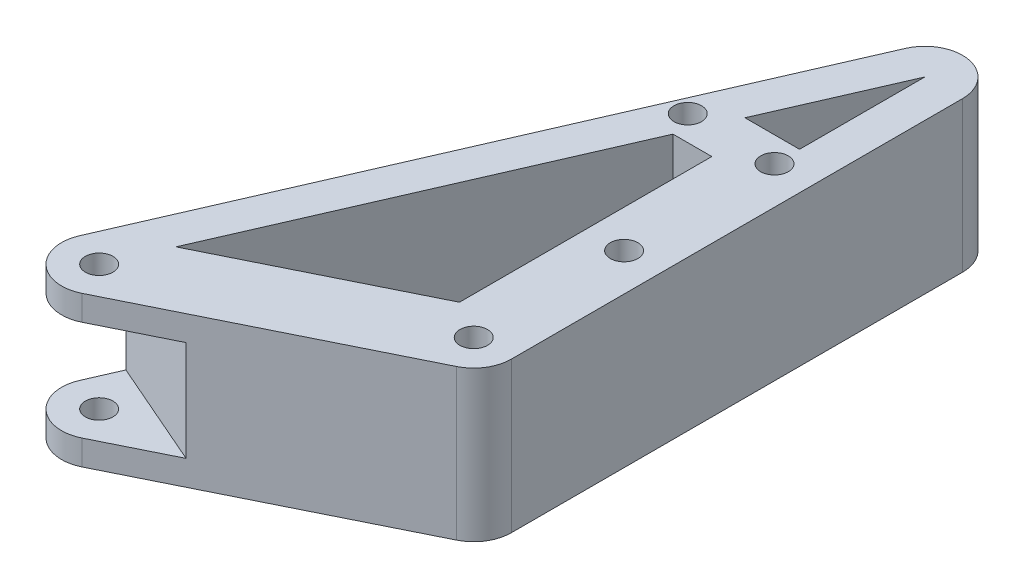
ISO-10303-21;
HEADER;
FILE_DESCRIPTION(('STEP AP214'),'2;1');
FILE_NAME('part.step','',(''),(''),'','','');
FILE_SCHEMA(('AUTOMOTIVE_DESIGN { 1 0 10303 214 1 1 1 1 }'));
ENDSEC;
DATA;
#1=APPLICATION_CONTEXT('core data for automotive mechanical design processes');
#2=APPLICATION_PROTOCOL_DEFINITION('international standard','automotive_design',2000,#1);
#3=PRODUCT_CONTEXT('',#1,'mechanical');
#4=PRODUCT('Part','Part','',(#3));
#5=PRODUCT_RELATED_PRODUCT_CATEGORY('part','',(#4));
#6=PRODUCT_DEFINITION_FORMATION('','',#4);
#7=PRODUCT_DEFINITION_CONTEXT('part definition',#1,'design');
#8=PRODUCT_DEFINITION('design','',#6,#7);
#9=PRODUCT_DEFINITION_SHAPE('','',#8);
#10=(LENGTH_UNIT() NAMED_UNIT(*) SI_UNIT(.MILLI.,.METRE.));
#11=(NAMED_UNIT(*) PLANE_ANGLE_UNIT() SI_UNIT($,.RADIAN.));
#12=(NAMED_UNIT(*) SI_UNIT($,.STERADIAN.) SOLID_ANGLE_UNIT());
#13=UNCERTAINTY_MEASURE_WITH_UNIT(LENGTH_MEASURE(1.E-05),#10,'distance_accuracy_value','');
#14=(GEOMETRIC_REPRESENTATION_CONTEXT(3) GLOBAL_UNCERTAINTY_ASSIGNED_CONTEXT((#13)) GLOBAL_UNIT_ASSIGNED_CONTEXT((#10,
#11,#12)) REPRESENTATION_CONTEXT('',''));
#15=CARTESIAN_POINT('',(0.,0.,0.));
#16=DIRECTION('',(0.,0.,1.));
#17=DIRECTION('',(1.,0.,0.));
#18=AXIS2_PLACEMENT_3D('',#15,#16,#17);
#19=CARTESIAN_POINT('',(-6.49728373742447,30.,-13.1415287829184));
#20=DIRECTION('',(-0.443199232411597,0.,-0.896423136911231));
#21=DIRECTION('',(-0.896423136911231,0.,0.443199232411597));
#22=AXIS2_PLACEMENT_3D('',#19,#20,#21);
#23=PLANE('',#22);
#24=DIRECTION('',(-0.896423136911231,0.,0.443199232411597));
#25=VECTOR('',#24,1.);
#26=CARTESIAN_POINT('',(-6.49728373742447,25.,-13.1415287829184));
#27=LINE('',#26,#25);
#28=CARTESIAN_POINT('',(-32.7975945113373,25.,-0.138431175076462));
#29=VERTEX_POINT('',#28);
#30=CARTESIAN_POINT('',(-46.676005756913,25.,6.72317352683422));
#31=VERTEX_POINT('',#30);
#32=EDGE_CURVE('E390',#29,#31,#27,.T.);
#33=ORIENTED_EDGE('',*,*,#32,.F.);
#34=DIRECTION('',(0.,1.,0.));
#35=VECTOR('',#34,1.);
#36=CARTESIAN_POINT('',(-32.7975945113373,30.,-0.13843117507647));
#37=LINE('',#36,#35);
#38=CARTESIAN_POINT('',(-32.7975945113373,5.,-0.138431175076467));
#39=VERTEX_POINT('',#38);
#40=EDGE_CURVE('E206',#39,#29,#37,.T.);
#41=ORIENTED_EDGE('',*,*,#40,.F.);
#42=DIRECTION('',(0.896423136911231,0.,-0.443199232411597));
#43=VECTOR('',#42,1.);
#44=CARTESIAN_POINT('',(-6.49728373742447,5.,-13.1415287829184));
#45=LINE('',#44,#43);
#46=CARTESIAN_POINT('',(-46.676005756913,5.,6.72317352683422));
#47=VERTEX_POINT('',#46);
#48=EDGE_CURVE('E391',#47,#39,#45,.T.);
#49=ORIENTED_EDGE('',*,*,#48,.F.);
#50=DIRECTION('',(0.,-1.,0.));
#51=VECTOR('',#50,1.);
#52=CARTESIAN_POINT('',(-46.676005756913,30.,6.72317352683423));
#53=LINE('',#52,#51);
#54=CARTESIAN_POINT('',(-46.676005756913,0.,6.72317352683423));
#55=VERTEX_POINT('',#54);
#56=EDGE_CURVE('E179',#47,#55,#53,.T.);
#57=ORIENTED_EDGE('',*,*,#56,.T.);
#58=DIRECTION('',(0.896423136911231,0.,-0.443199232411597));
#59=VECTOR('',#58,1.);
#60=CARTESIAN_POINT('',(-6.49728373742447,0.,-13.1415287829184));
#61=LINE('',#60,#59);
#62=CARTESIAN_POINT('',(3.32399424308698,0.,-17.9972522499207));
#63=VERTEX_POINT('',#62);
#64=EDGE_CURVE('E199',#55,#63,#61,.T.);
#65=ORIENTED_EDGE('',*,*,#64,.T.);
#66=DIRECTION('',(0.,-1.,0.));
#67=VECTOR('',#66,1.);
#68=CARTESIAN_POINT('',(3.32399424308698,30.,-17.9972522499207));
#69=LINE('',#68,#67);
#70=CARTESIAN_POINT('',(3.32399424308698,30.,-17.9972522499207));
#71=VERTEX_POINT('',#70);
#72=EDGE_CURVE('E169',#71,#63,#69,.T.);
#73=ORIENTED_EDGE('',*,*,#72,.F.);
#74=DIRECTION('',(0.896423136911231,0.,-0.443199232411597));
#75=VECTOR('',#74,1.);
#76=CARTESIAN_POINT('',(-6.49728373742447,30.,-13.1415287829184));
#77=LINE('',#76,#75);
#78=CARTESIAN_POINT('',(-46.676005756913,30.,6.72317352683423));
#79=VERTEX_POINT('',#78);
#80=EDGE_CURVE('E257',#79,#71,#77,.T.);
#81=ORIENTED_EDGE('',*,*,#80,.F.);
#82=EDGE_CURVE('E175',#79,#31,#53,.T.);
#83=ORIENTED_EDGE('',*,*,#82,.T.);
#84=EDGE_LOOP('',(#33,#41,#49,#57,#65,#73,#81,#83));
#85=FACE_BOUND('',#84,.T.);
#86=ADVANCED_FACE('F33',(#85),#23,.F.);
#87=CARTESIAN_POINT('',(-48.8936344096675,30.,-21.3099080127257));
#88=DIRECTION('',(0.916714519503143,0.,0.399542850933566));
#89=DIRECTION('',(0.399542850933566,0.,-0.916714519503143));
#90=AXIS2_PLACEMENT_3D('',#87,#88,#89);
#91=PLANE('',#90);
#92=DIRECTION('',(-0.399542850933566,0.,0.916714519503143));
#93=VECTOR('',#92,1.);
#94=CARTESIAN_POINT('',(-48.8936344096675,25.,-21.3099080127257));
#95=LINE('',#94,#93);
#96=CARTESIAN_POINT('',(-54.0785589397386,25.,-9.41357301852373));
#97=VERTEX_POINT('',#96);
#98=CARTESIAN_POINT('',(-56.8753588962736,25.,-2.99657138200173));
#99=VERTEX_POINT('',#98);
#100=EDGE_CURVE('E424',#97,#99,#95,.T.);
#101=ORIENTED_EDGE('',*,*,#100,.T.);
#102=DIRECTION('',(0.,-1.,0.));
#103=VECTOR('',#102,1.);
#104=CARTESIAN_POINT('',(-56.8753588962736,30.,-2.99657138200173));
#105=LINE('',#104,#103);
#106=CARTESIAN_POINT('',(-56.8753588962736,30.,-2.99657138200173));
#107=VERTEX_POINT('',#106);
#108=EDGE_CURVE('E180',#107,#99,#105,.T.);
#109=ORIENTED_EDGE('',*,*,#108,.F.);
#110=DIRECTION('',(-0.399542850933566,0.,0.916714519503143));
#111=VECTOR('',#110,1.);
#112=CARTESIAN_POINT('',(-48.8936344096675,30.,-21.3099080127257));
#113=LINE('',#112,#111);
#114=CARTESIAN_POINT('',(-6.87535889627355,30.,-117.716997158757));
#115=VERTEX_POINT('',#114);
#116=EDGE_CURVE('E269',#115,#107,#113,.T.);
#117=ORIENTED_EDGE('',*,*,#116,.F.);
#118=DIRECTION('',(0.,-1.,0.));
#119=VECTOR('',#118,1.);
#120=CARTESIAN_POINT('',(-6.87535889627355,30.,-117.716997158757));
#121=LINE('',#120,#119);
#122=CARTESIAN_POINT('',(-6.87535889627355,0.,-117.716997158757));
#123=VERTEX_POINT('',#122);
#124=EDGE_CURVE('E183',#115,#123,#121,.T.);
#125=ORIENTED_EDGE('',*,*,#124,.T.);
#126=DIRECTION('',(-0.399542850933566,0.,0.916714519503143));
#127=VECTOR('',#126,1.);
#128=CARTESIAN_POINT('',(-48.8936344096675,0.,-21.3099080127257));
#129=LINE('',#128,#127);
#130=CARTESIAN_POINT('',(-56.8753588962736,0.,-2.99657138200173));
#131=VERTEX_POINT('',#130);
#132=EDGE_CURVE('E220',#123,#131,#129,.T.);
#133=ORIENTED_EDGE('',*,*,#132,.T.);
#134=CARTESIAN_POINT('',(-56.8753588962736,5.,-2.99657138200173));
#135=VERTEX_POINT('',#134);
#136=EDGE_CURVE('E178',#135,#131,#105,.T.);
#137=ORIENTED_EDGE('',*,*,#136,.F.);
#138=DIRECTION('',(0.399542850933566,0.,-0.916714519503143));
#139=VECTOR('',#138,1.);
#140=CARTESIAN_POINT('',(-48.8936344096675,5.,-21.3099080127257));
#141=LINE('',#140,#139);
#142=CARTESIAN_POINT('',(-54.0785589397386,5.,-9.41357301852373));
#143=VERTEX_POINT('',#142);
#144=EDGE_CURVE('E47',#135,#143,#141,.T.);
#145=ORIENTED_EDGE('',*,*,#144,.T.);
#146=DIRECTION('',(0.,1.,0.));
#147=VECTOR('',#146,1.);
#148=CARTESIAN_POINT('',(-54.0785589397386,0.,-9.41357301852373));
#149=LINE('',#148,#147);
#150=EDGE_CURVE('E427',#143,#97,#149,.T.);
#151=ORIENTED_EDGE('',*,*,#150,.T.);
#152=EDGE_LOOP('',(#101,#109,#117,#125,#133,#137,#145,#151));
#153=FACE_BOUND('',#152,.T.);
#154=ADVANCED_FACE('F316',(#153),#91,.F.);
#155=CARTESIAN_POINT('',(-50.,30.,0.));
#156=DIRECTION('',(0.,-1.,0.));
#157=DIRECTION('',(0.,0.,-1.));
#158=AXIS2_PLACEMENT_3D('',#155,#156,#157);
#159=CYLINDRICAL_SURFACE('',#158,2.75);
#160=CARTESIAN_POINT('',(-50.,30.,0.));
#161=DIRECTION('',(0.,1.,0.));
#162=DIRECTION('',(0.,0.,1.));
#163=AXIS2_PLACEMENT_3D('',#160,#161,#162);
#164=CIRCLE('',#163,2.75);
#165=CARTESIAN_POINT('',(-50.,30.,2.75000000000001));
#166=VERTEX_POINT('',#165);
#167=EDGE_CURVE('E292',#166,#166,#164,.T.);
#168=ORIENTED_EDGE('',*,*,#167,.T.);
#169=EDGE_LOOP('',(#168));
#170=FACE_BOUND('',#169,.T.);
#171=CARTESIAN_POINT('',(-50.,25.,0.));
#172=DIRECTION('',(0.,-1.,0.));
#173=DIRECTION('',(0.,0.,-1.));
#174=AXIS2_PLACEMENT_3D('',#171,#172,#173);
#175=CIRCLE('',#174,2.75);
#176=CARTESIAN_POINT('',(-50.,25.,-2.75));
#177=VERTEX_POINT('',#176);
#178=EDGE_CURVE('E211',#177,#177,#175,.T.);
#179=ORIENTED_EDGE('',*,*,#178,.T.);
#180=EDGE_LOOP('',(#179));
#181=FACE_BOUND('',#180,.T.);
#182=ADVANCED_FACE('F320',(#170,#181),#159,.F.);
#183=CARTESIAN_POINT('',(-50.,0.,0.));
#184=DIRECTION('',(0.,1.,0.));
#185=DIRECTION('',(0.,0.,1.));
#186=AXIS2_PLACEMENT_3D('',#183,#184,#185);
#187=CIRCLE('',#186,2.75);
#188=CARTESIAN_POINT('',(-50.,0.,2.75000000000001));
#189=VERTEX_POINT('',#188);
#190=EDGE_CURVE('E252',#189,#189,#187,.T.);
#191=ORIENTED_EDGE('',*,*,#190,.F.);
#192=EDGE_LOOP('',(#191));
#193=FACE_BOUND('',#192,.T.);
#194=CARTESIAN_POINT('',(-50.,5.,0.));
#195=DIRECTION('',(0.,1.,0.));
#196=DIRECTION('',(0.,0.,1.));
#197=AXIS2_PLACEMENT_3D('',#194,#195,#196);
#198=CIRCLE('',#197,2.75);
#199=CARTESIAN_POINT('',(-50.,5.,2.75000000000001));
#200=VERTEX_POINT('',#199);
#201=EDGE_CURVE('E388',#200,#200,#198,.T.);
#202=ORIENTED_EDGE('',*,*,#201,.T.);
#203=EDGE_LOOP('',(#202));
#204=FACE_BOUND('',#203,.T.);
#205=ADVANCED_FACE('F326',(#193,#204),#159,.F.);
#206=CARTESIAN_POINT('',(-50.,30.,0.));
#207=DIRECTION('',(0.,-1.,0.));
#208=DIRECTION('',(0.,0.,-1.));
#209=AXIS2_PLACEMENT_3D('',#206,#207,#208);
#210=CYLINDRICAL_SURFACE('',#209,7.49999999999999);
#211=CARTESIAN_POINT('',(-50.,25.,0.));
#212=DIRECTION('',(0.,-1.,0.));
#213=DIRECTION('',(0.,0.,-1.));
#214=AXIS2_PLACEMENT_3D('',#211,#212,#213);
#215=CIRCLE('',#214,7.49999999999999);
#216=EDGE_CURVE('E11',#31,#99,#215,.T.);
#217=ORIENTED_EDGE('',*,*,#216,.F.);
#218=ORIENTED_EDGE('',*,*,#82,.F.);
#219=CARTESIAN_POINT('',(-50.,30.,0.));
#220=DIRECTION('',(0.,1.,0.));
#221=DIRECTION('',(0.,0.,1.));
#222=AXIS2_PLACEMENT_3D('',#219,#220,#221);
#223=CIRCLE('',#222,7.49999999999999);
#224=EDGE_CURVE('E271',#107,#79,#223,.T.);
#225=ORIENTED_EDGE('',*,*,#224,.F.);
#226=ORIENTED_EDGE('',*,*,#108,.T.);
#227=EDGE_LOOP('',(#217,#218,#225,#226));
#228=FACE_BOUND('',#227,.T.);
#229=ADVANCED_FACE('F331',(#228),#210,.T.);
#230=CARTESIAN_POINT('',(-50.,5.,0.));
#231=DIRECTION('',(0.,1.,0.));
#232=DIRECTION('',(0.,0.,1.));
#233=AXIS2_PLACEMENT_3D('',#230,#231,#232);
#234=CIRCLE('',#233,7.49999999999999);
#235=EDGE_CURVE('E40',#135,#47,#234,.T.);
#236=ORIENTED_EDGE('',*,*,#235,.F.);
#237=ORIENTED_EDGE('',*,*,#136,.T.);
#238=CARTESIAN_POINT('',(-50.,0.,0.));
#239=DIRECTION('',(0.,1.,0.));
#240=DIRECTION('',(0.,0.,1.));
#241=AXIS2_PLACEMENT_3D('',#238,#239,#240);
#242=CIRCLE('',#241,7.49999999999999);
#243=EDGE_CURVE('E223',#131,#55,#242,.T.);
#244=ORIENTED_EDGE('',*,*,#243,.T.);
#245=ORIENTED_EDGE('',*,*,#56,.F.);
#246=EDGE_LOOP('',(#236,#237,#244,#245));
#247=FACE_BOUND('',#246,.T.);
#248=ADVANCED_FACE('F441',(#247),#210,.T.);
#249=CARTESIAN_POINT('',(0.,30.,0.));
#250=DIRECTION('',(1.,0.,0.));
#251=DIRECTION('',(0.,0.,-1.));
#252=AXIS2_PLACEMENT_3D('',#249,#250,#251);
#253=PLANE('',#252);
#254=DIRECTION('',(0.,0.,1.));
#255=VECTOR('',#254,1.);
#256=CARTESIAN_POINT('',(0.,0.,0.));
#257=LINE('',#256,#255);
#258=CARTESIAN_POINT('',(0.,0.,-114.720425776755));
#259=VERTEX_POINT('',#258);
#260=CARTESIAN_POINT('',(0.,0.,-89.7204257767549));
#261=VERTEX_POINT('',#260);
#262=EDGE_CURVE('E161',#259,#261,#257,.T.);
#263=ORIENTED_EDGE('',*,*,#262,.T.);
#264=DIRECTION('',(0.,-1.,0.));
#265=VECTOR('',#264,1.);
#266=CARTESIAN_POINT('',(0.,30.,-89.7204257767549));
#267=LINE('',#266,#265);
#268=CARTESIAN_POINT('',(0.,30.,-89.7204257767549));
#269=VERTEX_POINT('',#268);
#270=EDGE_CURVE('E149',#269,#261,#267,.T.);
#271=ORIENTED_EDGE('',*,*,#270,.F.);
#272=DIRECTION('',(0.,0.,1.));
#273=VECTOR('',#272,1.);
#274=CARTESIAN_POINT('',(0.,30.,0.));
#275=LINE('',#274,#273);
#276=CARTESIAN_POINT('',(0.,30.,-114.720425776755));
#277=VERTEX_POINT('',#276);
#278=EDGE_CURVE('E154',#277,#269,#275,.T.);
#279=ORIENTED_EDGE('',*,*,#278,.F.);
#280=DIRECTION('',(0.,-1.,0.));
#281=VECTOR('',#280,1.);
#282=CARTESIAN_POINT('',(0.,30.,-114.720425776755));
#283=LINE('',#282,#281);
#284=EDGE_CURVE('E56',#277,#259,#283,.T.);
#285=ORIENTED_EDGE('',*,*,#284,.T.);
#286=EDGE_LOOP('',(#263,#271,#279,#285));
#287=FACE_BOUND('',#286,.T.);
#288=ADVANCED_FACE('F160',(#287),#253,.F.);
#289=CARTESIAN_POINT('',(0.,30.,-89.7204257767549));
#290=DIRECTION('',(0.,0.,1.));
#291=DIRECTION('',(1.,0.,0.));
#292=AXIS2_PLACEMENT_3D('',#289,#290,#291);
#293=PLANE('',#292);
#294=DIRECTION('',(-1.,0.,0.));
#295=VECTOR('',#294,1.);
#296=CARTESIAN_POINT('',(0.,0.,-89.7204257767549));
#297=LINE('',#296,#295);
#298=CARTESIAN_POINT('',(-10.8960543995233,0.,-89.7204257767549));
#299=VERTEX_POINT('',#298);
#300=EDGE_CURVE('E247',#261,#299,#297,.T.);
#301=ORIENTED_EDGE('',*,*,#300,.T.);
#302=DIRECTION('',(0.,-1.,0.));
#303=VECTOR('',#302,1.);
#304=CARTESIAN_POINT('',(-10.8960543995233,30.,-89.7204257767549));
#305=LINE('',#304,#303);
#306=CARTESIAN_POINT('',(-10.8960543995233,30.,-89.7204257767549));
#307=VERTEX_POINT('',#306);
#308=EDGE_CURVE('E150',#307,#299,#305,.T.);
#309=ORIENTED_EDGE('',*,*,#308,.F.);
#310=DIRECTION('',(-1.,0.,0.));
#311=VECTOR('',#310,1.);
#312=CARTESIAN_POINT('',(0.,30.,-89.7204257767549));
#313=LINE('',#312,#311);
#314=EDGE_CURVE('E144',#269,#307,#313,.T.);
#315=ORIENTED_EDGE('',*,*,#314,.F.);
#316=ORIENTED_EDGE('',*,*,#270,.T.);
#317=EDGE_LOOP('',(#301,#309,#315,#316));
#318=FACE_BOUND('',#317,.T.);
#319=ADVANCED_FACE('F147',(#318),#293,.F.);
#320=CARTESIAN_POINT('',(-7.49999999999999,30.,0.));
#321=DIRECTION('',(1.,0.,0.));
#322=DIRECTION('',(0.,0.,-1.));
#323=AXIS2_PLACEMENT_3D('',#320,#321,#322);
#324=PLANE('',#323);
#325=DIRECTION('',(0.,0.,1.));
#326=VECTOR('',#325,1.);
#327=CARTESIAN_POINT('',(-7.49999999999999,0.,0.));
#328=LINE('',#327,#326);
#329=CARTESIAN_POINT('',(-7.50000000000001,0.,-79.7204257767549));
#330=VERTEX_POINT('',#329);
#331=CARTESIAN_POINT('',(-7.49999999999999,0.,-29.3789464964477));
#332=VERTEX_POINT('',#331);
#333=EDGE_CURVE('E228',#330,#332,#328,.T.);
#334=ORIENTED_EDGE('',*,*,#333,.T.);
#335=DIRECTION('',(0.,-1.,0.));
#336=VECTOR('',#335,1.);
#337=CARTESIAN_POINT('',(-7.49999999999999,30.,-29.3789464964477));
#338=LINE('',#337,#336);
#339=CARTESIAN_POINT('',(-7.49999999999999,30.,-29.3789464964477));
#340=VERTEX_POINT('',#339);
#341=EDGE_CURVE('E173',#340,#332,#338,.T.);
#342=ORIENTED_EDGE('',*,*,#341,.F.);
#343=DIRECTION('',(0.,0.,1.));
#344=VECTOR('',#343,1.);
#345=CARTESIAN_POINT('',(-7.49999999999999,30.,0.));
#346=LINE('',#345,#344);
#347=CARTESIAN_POINT('',(-7.50000000000001,30.,-79.7204257767549));
#348=VERTEX_POINT('',#347);
#349=EDGE_CURVE('E276',#348,#340,#346,.T.);
#350=ORIENTED_EDGE('',*,*,#349,.F.);
#351=DIRECTION('',(0.,-1.,0.));
#352=VECTOR('',#351,1.);
#353=CARTESIAN_POINT('',(-7.50000000000001,30.,-79.7204257767549));
#354=LINE('',#353,#352);
#355=EDGE_CURVE('E166',#348,#330,#354,.T.);
#356=ORIENTED_EDGE('',*,*,#355,.T.);
#357=EDGE_LOOP('',(#334,#342,#350,#356));
#358=FACE_BOUND('',#357,.T.);
#359=ADVANCED_FACE('F352',(#358),#324,.F.);
#360=CARTESIAN_POINT('',(-13.1452722235984,30.,-26.5878758365869));
#361=DIRECTION('',(-0.443199232411597,0.,-0.896423136911231));
#362=DIRECTION('',(-0.896423136911231,0.,0.443199232411597));
#363=AXIS2_PLACEMENT_3D('',#360,#361,#362);
#364=PLANE('',#363);
#365=DIRECTION('',(0.896423136911231,0.,-0.443199232411597));
#366=VECTOR('',#365,1.);
#367=CARTESIAN_POINT('',(-13.1452722235984,0.,-26.5878758365869));
#368=LINE('',#367,#366);
#369=CARTESIAN_POINT('',(-45.3518974521077,0.,-10.6646460669644));
#370=VERTEX_POINT('',#369);
#371=EDGE_CURVE('E231',#370,#332,#368,.T.);
#372=ORIENTED_EDGE('',*,*,#371,.F.);
#373=DIRECTION('',(0.,-1.,0.));
#374=VECTOR('',#373,1.);
#375=CARTESIAN_POINT('',(-45.3518974521077,30.,-10.6646460669644));
#376=LINE('',#375,#374);
#377=CARTESIAN_POINT('',(-45.3518974521077,30.,-10.6646460669644));
#378=VERTEX_POINT('',#377);
#379=EDGE_CURVE('E171',#378,#370,#376,.T.);
#380=ORIENTED_EDGE('',*,*,#379,.F.);
#381=DIRECTION('',(0.896423136911231,0.,-0.443199232411597));
#382=VECTOR('',#381,1.);
#383=CARTESIAN_POINT('',(-13.1452722235984,30.,-26.5878758365869));
#384=LINE('',#383,#382);
#385=EDGE_CURVE('E278',#378,#340,#384,.T.);
#386=ORIENTED_EDGE('',*,*,#385,.T.);
#387=ORIENTED_EDGE('',*,*,#341,.T.);
#388=EDGE_LOOP('',(#372,#380,#386,#387));
#389=FACE_BOUND('',#388,.T.);
#390=ADVANCED_FACE('F346',(#389),#364,.T.);
#391=CARTESIAN_POINT('',(-42.0182755133939,30.,-18.313336630724));
#392=DIRECTION('',(0.916714519503143,0.,0.399542850933566));
#393=DIRECTION('',(0.399542850933566,0.,-0.916714519503143));
#394=AXIS2_PLACEMENT_3D('',#391,#392,#393);
#395=PLANE('',#394);
#396=DIRECTION('',(-0.399542850933566,0.,0.916714519503143));
#397=VECTOR('',#396,1.);
#398=CARTESIAN_POINT('',(-42.0182755133939,0.,-18.313336630724));
#399=LINE('',#398,#397);
#400=CARTESIAN_POINT('',(-15.2544761593327,0.,-79.7204257767549));
#401=VERTEX_POINT('',#400);
#402=EDGE_CURVE('E234',#401,#370,#399,.T.);
#403=ORIENTED_EDGE('',*,*,#402,.F.);
#404=DIRECTION('',(0.,-1.,0.));
#405=VECTOR('',#404,1.);
#406=CARTESIAN_POINT('',(-15.2544761593327,30.,-79.7204257767549));
#407=LINE('',#406,#405);
#408=CARTESIAN_POINT('',(-15.2544761593327,30.,-79.7204257767549));
#409=VERTEX_POINT('',#408);
#410=EDGE_CURVE('E168',#409,#401,#407,.T.);
#411=ORIENTED_EDGE('',*,*,#410,.F.);
#412=DIRECTION('',(-0.399542850933566,0.,0.916714519503143));
#413=VECTOR('',#412,1.);
#414=CARTESIAN_POINT('',(-42.0182755133939,30.,-18.313336630724));
#415=LINE('',#414,#413);
#416=EDGE_CURVE('E281',#409,#378,#415,.T.);
#417=ORIENTED_EDGE('',*,*,#416,.T.);
#418=ORIENTED_EDGE('',*,*,#379,.T.);
#419=EDGE_LOOP('',(#403,#411,#417,#418));
#420=FACE_BOUND('',#419,.T.);
#421=ADVANCED_FACE('F342',(#420),#395,.T.);
#422=CARTESIAN_POINT('',(0.,30.,-24.7204257767549));
#423=DIRECTION('',(0.,-1.,0.));
#424=DIRECTION('',(0.,0.,-1.));
#425=AXIS2_PLACEMENT_3D('',#422,#423,#424);
#426=CYLINDRICAL_SURFACE('',#425,7.5);
#427=CARTESIAN_POINT('',(0.,0.,-24.7204257767549));
#428=DIRECTION('',(0.,1.,0.));
#429=DIRECTION('',(0.,0.,1.));
#430=AXIS2_PLACEMENT_3D('',#427,#428,#429);
#431=CIRCLE('',#430,7.5);
#432=CARTESIAN_POINT('',(7.5,0.,-24.7204257767549));
#433=VERTEX_POINT('',#432);
#434=EDGE_CURVE('E195',#63,#433,#431,.T.);
#435=ORIENTED_EDGE('',*,*,#434,.T.);
#436=DIRECTION('',(0.,-1.,0.));
#437=VECTOR('',#436,1.);
#438=CARTESIAN_POINT('',(7.5,30.,-24.7204257767549));
#439=LINE('',#438,#437);
#440=CARTESIAN_POINT('',(7.5,30.,-24.7204257767549));
#441=VERTEX_POINT('',#440);
#442=EDGE_CURVE('E189',#441,#433,#439,.T.);
#443=ORIENTED_EDGE('',*,*,#442,.F.);
#444=CARTESIAN_POINT('',(0.,30.,-24.7204257767549));
#445=DIRECTION('',(0.,1.,0.));
#446=DIRECTION('',(0.,0.,1.));
#447=AXIS2_PLACEMENT_3D('',#444,#445,#446);
#448=CIRCLE('',#447,7.5);
#449=EDGE_CURVE('E111',#71,#441,#448,.T.);
#450=ORIENTED_EDGE('',*,*,#449,.F.);
#451=ORIENTED_EDGE('',*,*,#72,.T.);
#452=EDGE_LOOP('',(#435,#443,#450,#451));
#453=FACE_BOUND('',#452,.T.);
#454=ADVANCED_FACE('F194',(#453),#426,.T.);
#455=CARTESIAN_POINT('',(7.5,30.,0.));
#456=DIRECTION('',(-1.,0.,0.));
#457=DIRECTION('',(0.,0.,1.));
#458=AXIS2_PLACEMENT_3D('',#455,#456,#457);
#459=PLANE('',#458);
#460=DIRECTION('',(0.,0.,-1.));
#461=VECTOR('',#460,1.);
#462=CARTESIAN_POINT('',(7.5,0.,0.));
#463=LINE('',#462,#461);
#464=CARTESIAN_POINT('',(7.5,0.,-114.720425776755));
#465=VERTEX_POINT('',#464);
#466=EDGE_CURVE('E208',#433,#465,#463,.T.);
#467=ORIENTED_EDGE('',*,*,#466,.T.);
#468=DIRECTION('',(0.,-1.,0.));
#469=VECTOR('',#468,1.);
#470=CARTESIAN_POINT('',(7.5,30.,-114.720425776755));
#471=LINE('',#470,#469);
#472=CARTESIAN_POINT('',(7.5,30.,-114.720425776755));
#473=VERTEX_POINT('',#472);
#474=EDGE_CURVE('E186',#473,#465,#471,.T.);
#475=ORIENTED_EDGE('',*,*,#474,.F.);
#476=DIRECTION('',(0.,0.,-1.));
#477=VECTOR('',#476,1.);
#478=CARTESIAN_POINT('',(7.5,30.,0.));
#479=LINE('',#478,#477);
#480=EDGE_CURVE('E262',#441,#473,#479,.T.);
#481=ORIENTED_EDGE('',*,*,#480,.F.);
#482=ORIENTED_EDGE('',*,*,#442,.T.);
#483=EDGE_LOOP('',(#467,#475,#481,#482));
#484=FACE_BOUND('',#483,.T.);
#485=ADVANCED_FACE('F337',(#484),#459,.F.);
#486=CARTESIAN_POINT('',(0.,30.,-114.720425776755));
#487=DIRECTION('',(0.,-1.,0.));
#488=DIRECTION('',(0.,0.,-1.));
#489=AXIS2_PLACEMENT_3D('',#486,#487,#488);
#490=CYLINDRICAL_SURFACE('',#489,7.49999999999999);
#491=CARTESIAN_POINT('',(0.,0.,-114.720425776755));
#492=DIRECTION('',(0.,1.,0.));
#493=DIRECTION('',(0.,0.,1.));
#494=AXIS2_PLACEMENT_3D('',#491,#492,#493);
#495=CIRCLE('',#494,7.49999999999999);
#496=EDGE_CURVE('E218',#465,#123,#495,.T.);
#497=ORIENTED_EDGE('',*,*,#496,.T.);
#498=ORIENTED_EDGE('',*,*,#124,.F.);
#499=CARTESIAN_POINT('',(0.,30.,-114.720425776755));
#500=DIRECTION('',(0.,1.,0.));
#501=DIRECTION('',(0.,0.,1.));
#502=AXIS2_PLACEMENT_3D('',#499,#500,#501);
#503=CIRCLE('',#502,7.49999999999999);
#504=EDGE_CURVE('E267',#473,#115,#503,.T.);
#505=ORIENTED_EDGE('',*,*,#504,.F.);
#506=ORIENTED_EDGE('',*,*,#474,.T.);
#507=EDGE_LOOP('',(#497,#498,#505,#506));
#508=FACE_BOUND('',#507,.T.);
#509=ADVANCED_FACE('F333',(#508),#490,.T.);
#510=CARTESIAN_POINT('',(-42.0182755133939,30.,-18.313336630724));
#511=DIRECTION('',(0.916714519503143,0.,0.399542850933566));
#512=DIRECTION('',(0.399542850933566,0.,-0.916714519503143));
#513=AXIS2_PLACEMENT_3D('',#510,#511,#512);
#514=PLANE('',#513);
#515=DIRECTION('',(-0.399542850933566,0.,0.916714519503143));
#516=VECTOR('',#515,1.);
#517=CARTESIAN_POINT('',(-42.0182755133939,0.,-18.313336630724));
#518=LINE('',#517,#516);
#519=EDGE_CURVE('E249',#259,#299,#518,.T.);
#520=ORIENTED_EDGE('',*,*,#519,.F.);
#521=ORIENTED_EDGE('',*,*,#284,.F.);
#522=DIRECTION('',(-0.399542850933566,0.,0.916714519503143));
#523=VECTOR('',#522,1.);
#524=CARTESIAN_POINT('',(-42.0182755133939,30.,-18.313336630724));
#525=LINE('',#524,#523);
#526=EDGE_CURVE('E153',#277,#307,#525,.T.);
#527=ORIENTED_EDGE('',*,*,#526,.T.);
#528=ORIENTED_EDGE('',*,*,#308,.T.);
#529=EDGE_LOOP('',(#520,#521,#527,#528));
#530=FACE_BOUND('',#529,.T.);
#531=ADVANCED_FACE('F336',(#530),#514,.T.);
#532=CARTESIAN_POINT('',(0.,30.,-84.7204257767549));
#533=DIRECTION('',(0.,-1.,0.));
#534=DIRECTION('',(0.,0.,-1.));
#535=AXIS2_PLACEMENT_3D('',#532,#533,#534);
#536=CYLINDRICAL_SURFACE('',#535,2.75);
#537=CARTESIAN_POINT('',(0.,30.,-84.7204257767549));
#538=DIRECTION('',(0.,1.,0.));
#539=DIRECTION('',(0.,0.,1.));
#540=AXIS2_PLACEMENT_3D('',#537,#538,#539);
#541=CIRCLE('',#540,2.75);
#542=CARTESIAN_POINT('',(0.,30.,-81.9704257767549));
#543=VERTEX_POINT('',#542);
#544=EDGE_CURVE('E158',#543,#543,#541,.T.);
#545=ORIENTED_EDGE('',*,*,#544,.T.);
#546=EDGE_LOOP('',(#545));
#547=FACE_BOUND('',#546,.T.);
#548=CARTESIAN_POINT('',(0.,0.,-84.7204257767549));
#549=DIRECTION('',(0.,1.,0.));
#550=DIRECTION('',(0.,0.,1.));
#551=AXIS2_PLACEMENT_3D('',#548,#549,#550);
#552=CIRCLE('',#551,2.75);
#553=CARTESIAN_POINT('',(0.,0.,-81.9704257767549));
#554=VERTEX_POINT('',#553);
#555=EDGE_CURVE('E243',#554,#554,#552,.T.);
#556=ORIENTED_EDGE('',*,*,#555,.F.);
#557=EDGE_LOOP('',(#556));
#558=FACE_BOUND('',#557,.T.);
#559=ADVANCED_FACE('F513',(#547,#558),#536,.F.);
#560=CARTESIAN_POINT('',(0.,30.,-54.7204257767549));
#561=DIRECTION('',(0.,-1.,0.));
#562=DIRECTION('',(0.,0.,-1.));
#563=AXIS2_PLACEMENT_3D('',#560,#561,#562);
#564=CYLINDRICAL_SURFACE('',#563,2.75);
#565=CARTESIAN_POINT('',(0.,30.,-54.7204257767549));
#566=DIRECTION('',(0.,1.,0.));
#567=DIRECTION('',(0.,0.,1.));
#568=AXIS2_PLACEMENT_3D('',#565,#566,#567);
#569=CIRCLE('',#568,2.75);
#570=CARTESIAN_POINT('',(0.,30.,-51.9704257767549));
#571=VERTEX_POINT('',#570);
#572=EDGE_CURVE('E287',#571,#571,#569,.T.);
#573=ORIENTED_EDGE('',*,*,#572,.T.);
#574=EDGE_LOOP('',(#573));
#575=FACE_BOUND('',#574,.T.);
#576=CARTESIAN_POINT('',(0.,0.,-54.7204257767549));
#577=DIRECTION('',(0.,1.,0.));
#578=DIRECTION('',(0.,0.,1.));
#579=AXIS2_PLACEMENT_3D('',#576,#577,#578);
#580=CIRCLE('',#579,2.75);
#581=CARTESIAN_POINT('',(0.,0.,-51.9704257767549));
#582=VERTEX_POINT('',#581);
#583=EDGE_CURVE('E240',#582,#582,#580,.T.);
#584=ORIENTED_EDGE('',*,*,#583,.F.);
#585=EDGE_LOOP('',(#584));
#586=FACE_BOUND('',#585,.T.);
#587=ADVANCED_FACE('F367',(#575,#586),#564,.F.);
#588=CARTESIAN_POINT('',(0.,30.,-79.7204257767549));
#589=DIRECTION('',(0.,0.,1.));
#590=DIRECTION('',(1.,0.,0.));
#591=AXIS2_PLACEMENT_3D('',#588,#589,#590);
#592=PLANE('',#591);
#593=DIRECTION('',(-1.,0.,0.));
#594=VECTOR('',#593,1.);
#595=CARTESIAN_POINT('',(0.,0.,-79.7204257767549));
#596=LINE('',#595,#594);
#597=EDGE_CURVE('E237',#330,#401,#596,.T.);
#598=ORIENTED_EDGE('',*,*,#597,.F.);
#599=ORIENTED_EDGE('',*,*,#355,.F.);
#600=DIRECTION('',(-1.,0.,0.));
#601=VECTOR('',#600,1.);
#602=CARTESIAN_POINT('',(0.,30.,-79.7204257767549));
#603=LINE('',#602,#601);
#604=EDGE_CURVE('E284',#348,#409,#603,.T.);
#605=ORIENTED_EDGE('',*,*,#604,.T.);
#606=ORIENTED_EDGE('',*,*,#410,.T.);
#607=EDGE_LOOP('',(#598,#599,#605,#606));
#608=FACE_BOUND('',#607,.T.);
#609=ADVANCED_FACE('F357',(#608),#592,.T.);
#610=CARTESIAN_POINT('',(-17.3043253974399,30.,-84.7204257767549));
#611=DIRECTION('',(0.,-1.,0.));
#612=DIRECTION('',(0.,0.,-1.));
#613=AXIS2_PLACEMENT_3D('',#610,#611,#612);
#614=CYLINDRICAL_SURFACE('',#613,2.75);
#615=CARTESIAN_POINT('',(-17.3043253974399,30.,-84.7204257767549));
#616=DIRECTION('',(0.,1.,0.));
#617=DIRECTION('',(0.,0.,1.));
#618=AXIS2_PLACEMENT_3D('',#615,#616,#617);
#619=CIRCLE('',#618,2.75);
#620=CARTESIAN_POINT('',(-17.3043253974399,30.,-81.9704257767549));
#621=VERTEX_POINT('',#620);
#622=EDGE_CURVE('E273',#621,#621,#619,.T.);
#623=ORIENTED_EDGE('',*,*,#622,.T.);
#624=EDGE_LOOP('',(#623));
#625=FACE_BOUND('',#624,.T.);
#626=CARTESIAN_POINT('',(-17.3043253974399,0.,-84.7204257767549));
#627=DIRECTION('',(0.,1.,0.));
#628=DIRECTION('',(0.,0.,1.));
#629=AXIS2_PLACEMENT_3D('',#626,#627,#628);
#630=CIRCLE('',#629,2.75);
#631=CARTESIAN_POINT('',(-17.3043253974399,0.,-81.9704257767549));
#632=VERTEX_POINT('',#631);
#633=EDGE_CURVE('E225',#632,#632,#630,.T.);
#634=ORIENTED_EDGE('',*,*,#633,.F.);
#635=EDGE_LOOP('',(#634));
#636=FACE_BOUND('',#635,.T.);
#637=ADVANCED_FACE('F311',(#625,#636),#614,.F.);
#638=CARTESIAN_POINT('',(0.,30.,-24.7204257767549));
#639=DIRECTION('',(0.,-1.,0.));
#640=DIRECTION('',(0.,0.,-1.));
#641=AXIS2_PLACEMENT_3D('',#638,#639,#640);
#642=CYLINDRICAL_SURFACE('',#641,2.75);
#643=CARTESIAN_POINT('',(0.,30.,-24.7204257767549));
#644=DIRECTION('',(0.,1.,0.));
#645=DIRECTION('',(0.,0.,1.));
#646=AXIS2_PLACEMENT_3D('',#643,#644,#645);
#647=CIRCLE('',#646,2.75);
#648=CARTESIAN_POINT('',(0.,30.,-21.9704257767549));
#649=VERTEX_POINT('',#648);
#650=EDGE_CURVE('E214',#649,#649,#647,.T.);
#651=ORIENTED_EDGE('',*,*,#650,.T.);
#652=EDGE_LOOP('',(#651));
#653=FACE_BOUND('',#652,.T.);
#654=CARTESIAN_POINT('',(0.,0.,-24.7204257767549));
#655=DIRECTION('',(0.,1.,0.));
#656=DIRECTION('',(0.,0.,1.));
#657=AXIS2_PLACEMENT_3D('',#654,#655,#656);
#658=CIRCLE('',#657,2.75);
#659=CARTESIAN_POINT('',(0.,0.,-21.9704257767549));
#660=VERTEX_POINT('',#659);
#661=EDGE_CURVE('E255',#660,#660,#658,.T.);
#662=ORIENTED_EDGE('',*,*,#661,.F.);
#663=EDGE_LOOP('',(#662));
#664=FACE_BOUND('',#663,.T.);
#665=ADVANCED_FACE('F299',(#653,#664),#642,.F.);
#666=CARTESIAN_POINT('',(0.,30.,0.));
#667=DIRECTION('',(0.,1.,0.));
#668=DIRECTION('',(0.,0.,1.));
#669=AXIS2_PLACEMENT_3D('',#666,#667,#668);
#670=PLANE('',#669);
#671=ORIENTED_EDGE('',*,*,#80,.T.);
#672=ORIENTED_EDGE('',*,*,#449,.T.);
#673=ORIENTED_EDGE('',*,*,#480,.T.);
#674=ORIENTED_EDGE('',*,*,#504,.T.);
#675=ORIENTED_EDGE('',*,*,#116,.T.);
#676=ORIENTED_EDGE('',*,*,#224,.T.);
#677=EDGE_LOOP('',(#671,#672,#673,#674,#675,#676));
#678=FACE_BOUND('',#677,.T.);
#679=ORIENTED_EDGE('',*,*,#622,.F.);
#680=EDGE_LOOP('',(#679));
#681=FACE_BOUND('',#680,.T.);
#682=ORIENTED_EDGE('',*,*,#349,.T.);
#683=ORIENTED_EDGE('',*,*,#385,.F.);
#684=ORIENTED_EDGE('',*,*,#416,.F.);
#685=ORIENTED_EDGE('',*,*,#604,.F.);
#686=EDGE_LOOP('',(#682,#683,#684,#685));
#687=FACE_BOUND('',#686,.T.);
#688=ORIENTED_EDGE('',*,*,#572,.F.);
#689=EDGE_LOOP('',(#688));
#690=FACE_BOUND('',#689,.T.);
#691=ORIENTED_EDGE('',*,*,#544,.F.);
#692=EDGE_LOOP('',(#691));
#693=FACE_BOUND('',#692,.T.);
#694=ORIENTED_EDGE('',*,*,#278,.T.);
#695=ORIENTED_EDGE('',*,*,#314,.T.);
#696=ORIENTED_EDGE('',*,*,#526,.F.);
#697=EDGE_LOOP('',(#694,#695,#696));
#698=FACE_BOUND('',#697,.T.);
#699=ORIENTED_EDGE('',*,*,#167,.F.);
#700=EDGE_LOOP('',(#699));
#701=FACE_BOUND('',#700,.T.);
#702=ORIENTED_EDGE('',*,*,#650,.F.);
#703=EDGE_LOOP('',(#702));
#704=FACE_BOUND('',#703,.T.);
#705=ADVANCED_FACE('F156',(#678,#681,#687,#690,#693,#698,#701,#704),#670,.T.);
#706=CARTESIAN_POINT('',(0.,0.,0.));
#707=DIRECTION('',(0.,1.,0.));
#708=DIRECTION('',(0.,0.,1.));
#709=AXIS2_PLACEMENT_3D('',#706,#707,#708);
#710=PLANE('',#709);
#711=ORIENTED_EDGE('',*,*,#64,.F.);
#712=ORIENTED_EDGE('',*,*,#243,.F.);
#713=ORIENTED_EDGE('',*,*,#132,.F.);
#714=ORIENTED_EDGE('',*,*,#496,.F.);
#715=ORIENTED_EDGE('',*,*,#466,.F.);
#716=ORIENTED_EDGE('',*,*,#434,.F.);
#717=EDGE_LOOP('',(#711,#712,#713,#714,#715,#716));
#718=FACE_BOUND('',#717,.T.);
#719=ORIENTED_EDGE('',*,*,#633,.T.);
#720=EDGE_LOOP('',(#719));
#721=FACE_BOUND('',#720,.T.);
#722=ORIENTED_EDGE('',*,*,#333,.F.);
#723=ORIENTED_EDGE('',*,*,#597,.T.);
#724=ORIENTED_EDGE('',*,*,#402,.T.);
#725=ORIENTED_EDGE('',*,*,#371,.T.);
#726=EDGE_LOOP('',(#722,#723,#724,#725));
#727=FACE_BOUND('',#726,.T.);
#728=ORIENTED_EDGE('',*,*,#583,.T.);
#729=EDGE_LOOP('',(#728));
#730=FACE_BOUND('',#729,.T.);
#731=ORIENTED_EDGE('',*,*,#555,.T.);
#732=EDGE_LOOP('',(#731));
#733=FACE_BOUND('',#732,.T.);
#734=ORIENTED_EDGE('',*,*,#262,.F.);
#735=ORIENTED_EDGE('',*,*,#519,.T.);
#736=ORIENTED_EDGE('',*,*,#300,.F.);
#737=EDGE_LOOP('',(#734,#735,#736));
#738=FACE_BOUND('',#737,.T.);
#739=ORIENTED_EDGE('',*,*,#190,.T.);
#740=EDGE_LOOP('',(#739));
#741=FACE_BOUND('',#740,.T.);
#742=ORIENTED_EDGE('',*,*,#661,.T.);
#743=EDGE_LOOP('',(#742));
#744=FACE_BOUND('',#743,.T.);
#745=ADVANCED_FACE('F303',(#718,#721,#727,#730,#733,#738,#741,#744),#710,.F.);
#746=CARTESIAN_POINT('',(-22.9102652766317,0.,4.17088391321751));
#747=DIRECTION('',(-0.399542850933566,0.,0.916714519503143));
#748=DIRECTION('',(0.916714519503143,0.,0.399542850933566));
#749=AXIS2_PLACEMENT_3D('',#746,#747,#748);
#750=PLANE('',#749);
#751=ORIENTED_EDGE('',*,*,#40,.T.);
#752=DIRECTION('',(-0.916714519503143,0.,-0.399542850933566));
#753=VECTOR('',#752,1.);
#754=CARTESIAN_POINT('',(-22.9102652766317,25.,4.17088391321751));
#755=LINE('',#754,#753);
#756=EDGE_CURVE('E413',#29,#97,#755,.T.);
#757=ORIENTED_EDGE('',*,*,#756,.T.);
#758=ORIENTED_EDGE('',*,*,#150,.F.);
#759=DIRECTION('',(-0.916714519503143,0.,-0.399542850933566));
#760=VECTOR('',#759,1.);
#761=CARTESIAN_POINT('',(-22.9102652766317,5.,4.17088391321751));
#762=LINE('',#761,#760);
#763=EDGE_CURVE('E396',#39,#143,#762,.T.);
#764=ORIENTED_EDGE('',*,*,#763,.F.);
#765=EDGE_LOOP('',(#751,#757,#758,#764));
#766=FACE_BOUND('',#765,.T.);
#767=ADVANCED_FACE('F309',(#766),#750,.T.);
#768=CARTESIAN_POINT('',(-17.7253407465606,25.,-7.72545108098447));
#769=DIRECTION('',(0.,-1.,0.));
#770=DIRECTION('',(0.,0.,-1.));
#771=AXIS2_PLACEMENT_3D('',#768,#769,#770);
#772=PLANE('',#771);
#773=ORIENTED_EDGE('',*,*,#178,.F.);
#774=EDGE_LOOP('',(#773));
#775=FACE_BOUND('',#774,.T.);
#776=ORIENTED_EDGE('',*,*,#32,.T.);
#777=ORIENTED_EDGE('',*,*,#216,.T.);
#778=ORIENTED_EDGE('',*,*,#100,.F.);
#779=ORIENTED_EDGE('',*,*,#756,.F.);
#780=EDGE_LOOP('',(#776,#777,#778,#779));
#781=FACE_BOUND('',#780,.T.);
#782=ADVANCED_FACE('F403',(#775,#781),#772,.T.);
#783=CARTESIAN_POINT('',(-17.7253407465606,5.,-7.72545108098447));
#784=DIRECTION('',(0.,1.,0.));
#785=DIRECTION('',(0.,0.,1.));
#786=AXIS2_PLACEMENT_3D('',#783,#784,#785);
#787=PLANE('',#786);
#788=ORIENTED_EDGE('',*,*,#201,.F.);
#789=EDGE_LOOP('',(#788));
#790=FACE_BOUND('',#789,.T.);
#791=ORIENTED_EDGE('',*,*,#48,.T.);
#792=ORIENTED_EDGE('',*,*,#763,.T.);
#793=ORIENTED_EDGE('',*,*,#144,.F.);
#794=ORIENTED_EDGE('',*,*,#235,.T.);
#795=EDGE_LOOP('',(#791,#792,#793,#794));
#796=FACE_BOUND('',#795,.T.);
#797=ADVANCED_FACE('F406',(#790,#796),#787,.T.);
#798=CLOSED_SHELL('',(#86,#154,#182,#205,#229,#248,#288,#319,#359,#390,#421,#454,#485,#509,#531,
#559,#587,#609,#637,#665,#705,#745,#767,#782,#797));
#799=MANIFOLD_SOLID_BREP('B2',#798);
#800=ADVANCED_BREP_SHAPE_REPRESENTATION('',(#18,#799),#14);
#801=SHAPE_DEFINITION_REPRESENTATION(#9,#800);
ENDSEC;
END-ISO-10303-21;
